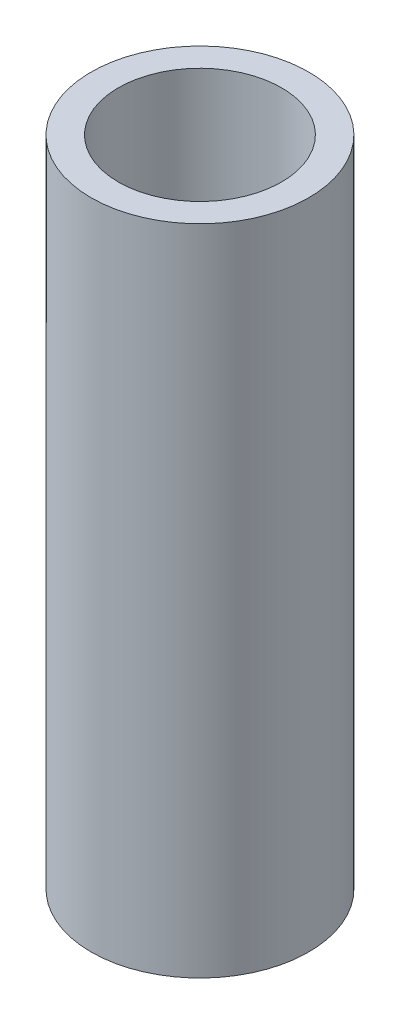
ISO-10303-21;
HEADER;
FILE_DESCRIPTION(('STEP AP214'),'2;1');
FILE_NAME('part.step','',(''),(''),'','','');
FILE_SCHEMA(('AUTOMOTIVE_DESIGN { 1 0 10303 214 1 1 1 1 }'));
ENDSEC;
DATA;
#1=APPLICATION_CONTEXT('core data for automotive mechanical design processes');
#2=APPLICATION_PROTOCOL_DEFINITION('international standard','automotive_design',2000,#1);
#3=PRODUCT_CONTEXT('',#1,'mechanical');
#4=PRODUCT('Part','Part','',(#3));
#5=PRODUCT_RELATED_PRODUCT_CATEGORY('part','',(#4));
#6=PRODUCT_DEFINITION_FORMATION('','',#4);
#7=PRODUCT_DEFINITION_CONTEXT('part definition',#1,'design');
#8=PRODUCT_DEFINITION('design','',#6,#7);
#9=PRODUCT_DEFINITION_SHAPE('','',#8);
#10=(LENGTH_UNIT() NAMED_UNIT(*) SI_UNIT(.MILLI.,.METRE.));
#11=(NAMED_UNIT(*) PLANE_ANGLE_UNIT() SI_UNIT($,.RADIAN.));
#12=(NAMED_UNIT(*) SI_UNIT($,.STERADIAN.) SOLID_ANGLE_UNIT());
#13=UNCERTAINTY_MEASURE_WITH_UNIT(LENGTH_MEASURE(1.E-05),#10,'distance_accuracy_value','');
#14=(GEOMETRIC_REPRESENTATION_CONTEXT(3) GLOBAL_UNCERTAINTY_ASSIGNED_CONTEXT((#13)) GLOBAL_UNIT_ASSIGNED_CONTEXT((#10,
#11,#12)) REPRESENTATION_CONTEXT('',''));
#15=CARTESIAN_POINT('',(0.,0.,0.));
#16=DIRECTION('',(0.,0.,1.));
#17=DIRECTION('',(1.,0.,0.));
#18=AXIS2_PLACEMENT_3D('',#15,#16,#17);
#19=CARTESIAN_POINT('',(-391.18166808322,76.2,-212.743279788072));
#20=DIRECTION('',(0.,1.,0.));
#21=DIRECTION('',(0.,0.,1.));
#22=AXIS2_PLACEMENT_3D('',#19,#20,#21);
#23=PLANE('',#22);
#24=CARTESIAN_POINT('',(-391.18166808322,76.2,-212.743279788072));
#25=DIRECTION('',(0.,1.,0.));
#26=DIRECTION('',(0.,0.,1.));
#27=AXIS2_PLACEMENT_3D('',#24,#25,#26);
#28=CIRCLE('',#27,12.7);
#29=CARTESIAN_POINT('',(-391.18166808322,76.2,-200.043279788072));
#30=VERTEX_POINT('',#29);
#31=EDGE_CURVE('E10',#30,#30,#28,.T.);
#32=ORIENTED_EDGE('',*,*,#31,.T.);
#33=EDGE_LOOP('',(#32));
#34=FACE_BOUND('',#33,.T.);
#35=CARTESIAN_POINT('',(-391.18166808322,76.2,-212.743279788072));
#36=DIRECTION('',(0.,1.,0.));
#37=DIRECTION('',(0.,0.,1.));
#38=AXIS2_PLACEMENT_3D('',#35,#36,#37);
#39=CIRCLE('',#38,9.52500000000002);
#40=CARTESIAN_POINT('',(-391.18166808322,76.2,-203.218279788071));
#41=VERTEX_POINT('',#40);
#42=EDGE_CURVE('E42',#41,#41,#39,.T.);
#43=ORIENTED_EDGE('',*,*,#42,.F.);
#44=EDGE_LOOP('',(#43));
#45=FACE_BOUND('',#44,.T.);
#46=ADVANCED_FACE('F31',(#34,#45),#23,.T.);
#47=CARTESIAN_POINT('',(-391.18166808322,0.,-212.743279788072));
#48=DIRECTION('',(0.,1.,0.));
#49=DIRECTION('',(0.,0.,1.));
#50=AXIS2_PLACEMENT_3D('',#47,#48,#49);
#51=PLANE('',#50);
#52=CARTESIAN_POINT('',(-391.18166808322,0.,-212.743279788072));
#53=DIRECTION('',(0.,1.,0.));
#54=DIRECTION('',(0.,0.,1.));
#55=AXIS2_PLACEMENT_3D('',#52,#53,#54);
#56=CIRCLE('',#55,12.7);
#57=CARTESIAN_POINT('',(-391.18166808322,0.,-200.043279788072));
#58=VERTEX_POINT('',#57);
#59=EDGE_CURVE('E35',#58,#58,#56,.T.);
#60=ORIENTED_EDGE('',*,*,#59,.F.);
#61=EDGE_LOOP('',(#60));
#62=FACE_BOUND('',#61,.T.);
#63=CARTESIAN_POINT('',(-391.18166808322,0.,-212.743279788072));
#64=DIRECTION('',(0.,1.,0.));
#65=DIRECTION('',(0.,0.,1.));
#66=AXIS2_PLACEMENT_3D('',#63,#64,#65);
#67=CIRCLE('',#66,9.52500000000002);
#68=CARTESIAN_POINT('',(-391.18166808322,0.,-203.218279788071));
#69=VERTEX_POINT('',#68);
#70=EDGE_CURVE('E44',#69,#69,#67,.T.);
#71=ORIENTED_EDGE('',*,*,#70,.T.);
#72=EDGE_LOOP('',(#71));
#73=FACE_BOUND('',#72,.T.);
#74=ADVANCED_FACE('F54',(#62,#73),#51,.F.);
#75=CARTESIAN_POINT('',(-391.18166808322,76.2,-212.743279788072));
#76=DIRECTION('',(0.,-1.,0.));
#77=DIRECTION('',(0.,0.,-1.));
#78=AXIS2_PLACEMENT_3D('',#75,#76,#77);
#79=CYLINDRICAL_SURFACE('',#78,12.7);
#80=ORIENTED_EDGE('',*,*,#31,.F.);
#81=EDGE_LOOP('',(#80));
#82=FACE_BOUND('',#81,.T.);
#83=ORIENTED_EDGE('',*,*,#59,.T.);
#84=EDGE_LOOP('',(#83));
#85=FACE_BOUND('',#84,.T.);
#86=ADVANCED_FACE('F33',(#82,#85),#79,.T.);
#87=CARTESIAN_POINT('',(-391.18166808322,76.2,-212.743279788072));
#88=DIRECTION('',(0.,-1.,0.));
#89=DIRECTION('',(0.,0.,-1.));
#90=AXIS2_PLACEMENT_3D('',#87,#88,#89);
#91=CYLINDRICAL_SURFACE('',#90,9.52500000000002);
#92=ORIENTED_EDGE('',*,*,#42,.T.);
#93=EDGE_LOOP('',(#92));
#94=FACE_BOUND('',#93,.T.);
#95=ORIENTED_EDGE('',*,*,#70,.F.);
#96=EDGE_LOOP('',(#95));
#97=FACE_BOUND('',#96,.T.);
#98=ADVANCED_FACE('F50',(#94,#97),#91,.F.);
#99=CLOSED_SHELL('',(#46,#74,#86,#98));
#100=MANIFOLD_SOLID_BREP('B2',#99);
#101=ADVANCED_BREP_SHAPE_REPRESENTATION('',(#18,#100),#14);
#102=SHAPE_DEFINITION_REPRESENTATION(#9,#101);
ENDSEC;
END-ISO-10303-21;
